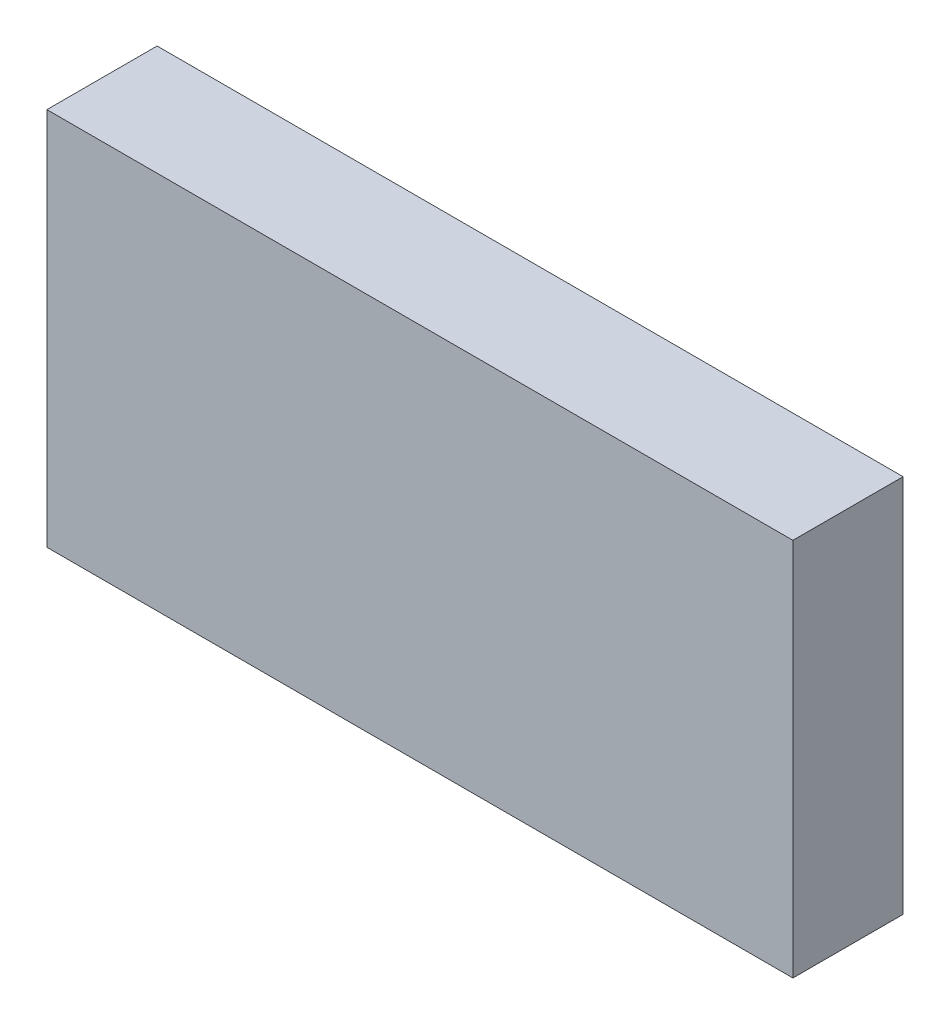
ISO-10303-21;
HEADER;
FILE_DESCRIPTION(('STEP AP214'),'2;1');
FILE_NAME('part.step','',(''),(''),'','','');
FILE_SCHEMA(('AUTOMOTIVE_DESIGN { 1 0 10303 214 1 1 1 1 }'));
ENDSEC;
DATA;
#1=APPLICATION_CONTEXT('core data for automotive mechanical design processes');
#2=APPLICATION_PROTOCOL_DEFINITION('international standard','automotive_design',2000,#1);
#3=PRODUCT_CONTEXT('',#1,'mechanical');
#4=PRODUCT('Part','Part','',(#3));
#5=PRODUCT_RELATED_PRODUCT_CATEGORY('part','',(#4));
#6=PRODUCT_DEFINITION_FORMATION('','',#4);
#7=PRODUCT_DEFINITION_CONTEXT('part definition',#1,'design');
#8=PRODUCT_DEFINITION('design','',#6,#7);
#9=PRODUCT_DEFINITION_SHAPE('','',#8);
#10=(LENGTH_UNIT() NAMED_UNIT(*) SI_UNIT(.MILLI.,.METRE.));
#11=(NAMED_UNIT(*) PLANE_ANGLE_UNIT() SI_UNIT($,.RADIAN.));
#12=(NAMED_UNIT(*) SI_UNIT($,.STERADIAN.) SOLID_ANGLE_UNIT());
#13=UNCERTAINTY_MEASURE_WITH_UNIT(LENGTH_MEASURE(1.E-05),#10,'distance_accuracy_value','');
#14=(GEOMETRIC_REPRESENTATION_CONTEXT(3) GLOBAL_UNCERTAINTY_ASSIGNED_CONTEXT((#13)) GLOBAL_UNIT_ASSIGNED_CONTEXT((#10,
#11,#12)) REPRESENTATION_CONTEXT('',''));
#15=CARTESIAN_POINT('',(0.,0.,0.));
#16=DIRECTION('',(0.,0.,1.));
#17=DIRECTION('',(1.,0.,0.));
#18=AXIS2_PLACEMENT_3D('',#15,#16,#17);
#19=CARTESIAN_POINT('',(-338.5,-172.,-50.));
#20=DIRECTION('',(-1.,0.,0.));
#21=DIRECTION('',(0.,0.,1.));
#22=AXIS2_PLACEMENT_3D('',#19,#20,#21);
#23=PLANE('',#22);
#24=DIRECTION('',(0.,1.,0.));
#25=VECTOR('',#24,1.);
#26=CARTESIAN_POINT('',(-338.5,-172.,50.));
#27=LINE('',#26,#25);
#28=CARTESIAN_POINT('',(-338.5,-172.,50.));
#29=VERTEX_POINT('',#28);
#30=CARTESIAN_POINT('',(-338.5,172.,50.));
#31=VERTEX_POINT('',#30);
#32=EDGE_CURVE('E36',#29,#31,#27,.T.);
#33=ORIENTED_EDGE('',*,*,#32,.T.);
#34=DIRECTION('',(0.,0.,1.));
#35=VECTOR('',#34,1.);
#36=CARTESIAN_POINT('',(-338.5,172.,-50.));
#37=LINE('',#36,#35);
#38=CARTESIAN_POINT('',(-338.5,172.,-50.));
#39=VERTEX_POINT('',#38);
#40=EDGE_CURVE('E73',#39,#31,#37,.T.);
#41=ORIENTED_EDGE('',*,*,#40,.F.);
#42=DIRECTION('',(0.,1.,0.));
#43=VECTOR('',#42,1.);
#44=CARTESIAN_POINT('',(-338.5,-172.,-50.));
#45=LINE('',#44,#43);
#46=CARTESIAN_POINT('',(-338.5,-172.,-50.));
#47=VERTEX_POINT('',#46);
#48=EDGE_CURVE('E11',#47,#39,#45,.T.);
#49=ORIENTED_EDGE('',*,*,#48,.F.);
#50=DIRECTION('',(0.,0.,1.));
#51=VECTOR('',#50,1.);
#52=CARTESIAN_POINT('',(-338.5,-172.,-50.));
#53=LINE('',#52,#51);
#54=EDGE_CURVE('E75',#47,#29,#53,.T.);
#55=ORIENTED_EDGE('',*,*,#54,.T.);
#56=EDGE_LOOP('',(#33,#41,#49,#55));
#57=FACE_BOUND('',#56,.T.);
#58=ADVANCED_FACE('F33',(#57),#23,.T.);
#59=CARTESIAN_POINT('',(-338.5,-172.,-50.));
#60=DIRECTION('',(0.,0.,1.));
#61=DIRECTION('',(1.,0.,0.));
#62=AXIS2_PLACEMENT_3D('',#59,#60,#61);
#63=PLANE('',#62);
#64=ORIENTED_EDGE('',*,*,#48,.T.);
#65=DIRECTION('',(1.,0.,0.));
#66=VECTOR('',#65,1.);
#67=CARTESIAN_POINT('',(-338.5,172.,-50.));
#68=LINE('',#67,#66);
#69=CARTESIAN_POINT('',(338.5,172.,-50.));
#70=VERTEX_POINT('',#69);
#71=EDGE_CURVE('E91',#39,#70,#68,.T.);
#72=ORIENTED_EDGE('',*,*,#71,.T.);
#73=DIRECTION('',(0.,1.,0.));
#74=VECTOR('',#73,1.);
#75=CARTESIAN_POINT('',(338.5,-172.,-50.));
#76=LINE('',#75,#74);
#77=CARTESIAN_POINT('',(338.5,-172.,-50.));
#78=VERTEX_POINT('',#77);
#79=EDGE_CURVE('E41',#78,#70,#76,.T.);
#80=ORIENTED_EDGE('',*,*,#79,.F.);
#81=DIRECTION('',(1.,0.,0.));
#82=VECTOR('',#81,1.);
#83=CARTESIAN_POINT('',(-338.5,-172.,-50.));
#84=LINE('',#83,#82);
#85=EDGE_CURVE('E54',#47,#78,#84,.T.);
#86=ORIENTED_EDGE('',*,*,#85,.F.);
#87=EDGE_LOOP('',(#64,#72,#80,#86));
#88=FACE_BOUND('',#87,.T.);
#89=ADVANCED_FACE('F106',(#88),#63,.F.);
#90=CARTESIAN_POINT('',(338.5,-172.,-50.));
#91=DIRECTION('',(-1.,0.,0.));
#92=DIRECTION('',(0.,0.,1.));
#93=AXIS2_PLACEMENT_3D('',#90,#91,#92);
#94=PLANE('',#93);
#95=ORIENTED_EDGE('',*,*,#79,.T.);
#96=DIRECTION('',(0.,0.,1.));
#97=VECTOR('',#96,1.);
#98=CARTESIAN_POINT('',(338.5,172.,-50.));
#99=LINE('',#98,#97);
#100=CARTESIAN_POINT('',(338.5,172.,50.));
#101=VERTEX_POINT('',#100);
#102=EDGE_CURVE('E87',#70,#101,#99,.T.);
#103=ORIENTED_EDGE('',*,*,#102,.T.);
#104=DIRECTION('',(0.,1.,0.));
#105=VECTOR('',#104,1.);
#106=CARTESIAN_POINT('',(338.5,-172.,50.));
#107=LINE('',#106,#105);
#108=CARTESIAN_POINT('',(338.5,-172.,50.));
#109=VERTEX_POINT('',#108);
#110=EDGE_CURVE('E79',#109,#101,#107,.T.);
#111=ORIENTED_EDGE('',*,*,#110,.F.);
#112=DIRECTION('',(0.,0.,1.));
#113=VECTOR('',#112,1.);
#114=CARTESIAN_POINT('',(338.5,-172.,-50.));
#115=LINE('',#114,#113);
#116=EDGE_CURVE('E99',#78,#109,#115,.T.);
#117=ORIENTED_EDGE('',*,*,#116,.F.);
#118=EDGE_LOOP('',(#95,#103,#111,#117));
#119=FACE_BOUND('',#118,.T.);
#120=ADVANCED_FACE('F104',(#119),#94,.F.);
#121=CARTESIAN_POINT('',(-338.5,-172.,50.));
#122=DIRECTION('',(0.,0.,1.));
#123=DIRECTION('',(1.,0.,0.));
#124=AXIS2_PLACEMENT_3D('',#121,#122,#123);
#125=PLANE('',#124);
#126=ORIENTED_EDGE('',*,*,#110,.T.);
#127=DIRECTION('',(1.,0.,0.));
#128=VECTOR('',#127,1.);
#129=CARTESIAN_POINT('',(-338.5,172.,50.));
#130=LINE('',#129,#128);
#131=EDGE_CURVE('E81',#31,#101,#130,.T.);
#132=ORIENTED_EDGE('',*,*,#131,.F.);
#133=ORIENTED_EDGE('',*,*,#32,.F.);
#134=DIRECTION('',(1.,0.,0.));
#135=VECTOR('',#134,1.);
#136=CARTESIAN_POINT('',(-338.5,-172.,50.));
#137=LINE('',#136,#135);
#138=EDGE_CURVE('E97',#29,#109,#137,.T.);
#139=ORIENTED_EDGE('',*,*,#138,.T.);
#140=EDGE_LOOP('',(#126,#132,#133,#139));
#141=FACE_BOUND('',#140,.T.);
#142=ADVANCED_FACE('F82',(#141),#125,.T.);
#143=CARTESIAN_POINT('',(0.,-172.,0.));
#144=DIRECTION('',(0.,1.,0.));
#145=DIRECTION('',(0.,0.,1.));
#146=AXIS2_PLACEMENT_3D('',#143,#144,#145);
#147=PLANE('',#146);
#148=ORIENTED_EDGE('',*,*,#54,.F.);
#149=ORIENTED_EDGE('',*,*,#85,.T.);
#150=ORIENTED_EDGE('',*,*,#116,.T.);
#151=ORIENTED_EDGE('',*,*,#138,.F.);
#152=EDGE_LOOP('',(#148,#149,#150,#151));
#153=FACE_BOUND('',#152,.T.);
#154=ADVANCED_FACE('F107',(#153),#147,.F.);
#155=CARTESIAN_POINT('',(0.,172.,0.));
#156=DIRECTION('',(0.,1.,0.));
#157=DIRECTION('',(0.,0.,1.));
#158=AXIS2_PLACEMENT_3D('',#155,#156,#157);
#159=PLANE('',#158);
#160=ORIENTED_EDGE('',*,*,#40,.T.);
#161=ORIENTED_EDGE('',*,*,#131,.T.);
#162=ORIENTED_EDGE('',*,*,#102,.F.);
#163=ORIENTED_EDGE('',*,*,#71,.F.);
#164=EDGE_LOOP('',(#160,#161,#162,#163));
#165=FACE_BOUND('',#164,.T.);
#166=ADVANCED_FACE('F89',(#165),#159,.T.);
#167=CLOSED_SHELL('',(#58,#89,#120,#142,#154,#166));
#168=MANIFOLD_SOLID_BREP('B2',#167);
#169=ADVANCED_BREP_SHAPE_REPRESENTATION('',(#18,#168),#14);
#170=SHAPE_DEFINITION_REPRESENTATION(#9,#169);
ENDSEC;
END-ISO-10303-21;
